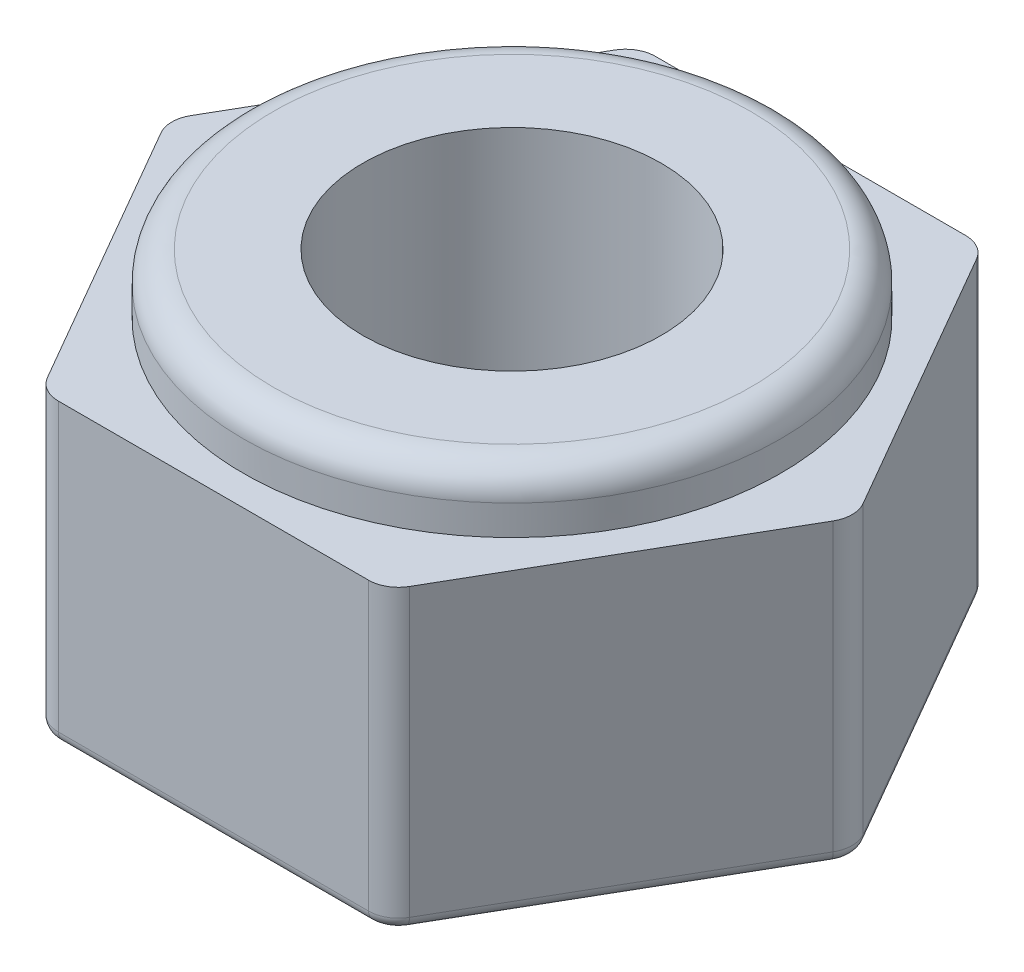
ISO-10303-21;
HEADER;
FILE_DESCRIPTION(('STEP AP214'),'2;1');
FILE_NAME('part.step','',(''),(''),'','','');
FILE_SCHEMA(('AUTOMOTIVE_DESIGN { 1 0 10303 214 1 1 1 1 }'));
ENDSEC;
DATA;
#1=APPLICATION_CONTEXT('core data for automotive mechanical design processes');
#2=APPLICATION_PROTOCOL_DEFINITION('international standard','automotive_design',2000,#1);
#3=PRODUCT_CONTEXT('',#1,'mechanical');
#4=PRODUCT('Part','Part','',(#3));
#5=PRODUCT_RELATED_PRODUCT_CATEGORY('part','',(#4));
#6=PRODUCT_DEFINITION_FORMATION('','',#4);
#7=PRODUCT_DEFINITION_CONTEXT('part definition',#1,'design');
#8=PRODUCT_DEFINITION('design','',#6,#7);
#9=PRODUCT_DEFINITION_SHAPE('','',#8);
#10=(LENGTH_UNIT() NAMED_UNIT(*) SI_UNIT(.MILLI.,.METRE.));
#11=(NAMED_UNIT(*) PLANE_ANGLE_UNIT() SI_UNIT($,.RADIAN.));
#12=(NAMED_UNIT(*) SI_UNIT($,.STERADIAN.) SOLID_ANGLE_UNIT());
#13=UNCERTAINTY_MEASURE_WITH_UNIT(LENGTH_MEASURE(1.E-05),#10,'distance_accuracy_value','');
#14=(GEOMETRIC_REPRESENTATION_CONTEXT(3) GLOBAL_UNCERTAINTY_ASSIGNED_CONTEXT((#13)) GLOBAL_UNIT_ASSIGNED_CONTEXT((#10,
#11,#12)) REPRESENTATION_CONTEXT('',''));
#15=CARTESIAN_POINT('',(0.,0.,0.));
#16=DIRECTION('',(0.,0.,1.));
#17=DIRECTION('',(1.,0.,0.));
#18=AXIS2_PLACEMENT_3D('',#15,#16,#17);
#19=CARTESIAN_POINT('',(-2.88675134594813,6.,-5.));
#20=DIRECTION('',(0.,1.,0.));
#21=DIRECTION('',(0.,0.,1.));
#22=AXIS2_PLACEMENT_3D('',#19,#20,#21);
#23=PLANE('',#22);
#24=CARTESIAN_POINT('',(0.,6.,0.));
#25=DIRECTION('',(0.,1.,0.));
#26=DIRECTION('',(0.,0.,1.));
#27=AXIS2_PLACEMENT_3D('',#24,#25,#26);
#28=CIRCLE('',#27,4.);
#29=CARTESIAN_POINT('',(0.,6.,4.));
#30=VERTEX_POINT('',#29);
#31=EDGE_CURVE('E11',#30,#30,#28,.T.);
#32=ORIENTED_EDGE('',*,*,#31,.T.);
#33=EDGE_LOOP('',(#32));
#34=FACE_BOUND('',#33,.T.);
#35=CARTESIAN_POINT('',(0.,6.,0.));
#36=DIRECTION('',(0.,1.,0.));
#37=DIRECTION('',(0.,0.,1.));
#38=AXIS2_PLACEMENT_3D('',#35,#36,#37);
#39=CIRCLE('',#38,2.5);
#40=CARTESIAN_POINT('',(0.,6.,2.5));
#41=VERTEX_POINT('',#40);
#42=EDGE_CURVE('E435',#41,#41,#39,.T.);
#43=ORIENTED_EDGE('',*,*,#42,.F.);
#44=EDGE_LOOP('',(#43));
#45=FACE_BOUND('',#44,.T.);
#46=ADVANCED_FACE('F36',(#34,#45),#23,.T.);
#47=CARTESIAN_POINT('',(2.88675134594813,6.,-5.));
#48=DIRECTION('',(0.,0.,1.));
#49=DIRECTION('',(1.,0.,0.));
#50=AXIS2_PLACEMENT_3D('',#47,#48,#49);
#51=PLANE('',#50);
#52=DIRECTION('',(-1.,0.,0.));
#53=VECTOR('',#52,1.);
#54=CARTESIAN_POINT('',(2.88675134594813,5.,-5.));
#55=LINE('',#54,#53);
#56=CARTESIAN_POINT('',(2.59807621135332,5.,-5.));
#57=VERTEX_POINT('',#56);
#58=CARTESIAN_POINT('',(-2.59807621135332,5.,-5.));
#59=VERTEX_POINT('',#58);
#60=EDGE_CURVE('E431',#57,#59,#55,.T.);
#61=ORIENTED_EDGE('',*,*,#60,.F.);
#62=DIRECTION('',(0.,-1.,0.));
#63=VECTOR('',#62,1.);
#64=CARTESIAN_POINT('',(2.59807621135332,6.,-5.));
#65=LINE('',#64,#63);
#66=CARTESIAN_POINT('',(2.59807621135332,0.2,-5.));
#67=VERTEX_POINT('',#66);
#68=EDGE_CURVE('E444',#57,#67,#65,.T.);
#69=ORIENTED_EDGE('',*,*,#68,.T.);
#70=DIRECTION('',(-1.,0.,0.));
#71=VECTOR('',#70,1.);
#72=CARTESIAN_POINT('',(2.88675134594813,0.2,-5.));
#73=LINE('',#72,#71);
#74=CARTESIAN_POINT('',(-2.59807621135332,0.2,-5.));
#75=VERTEX_POINT('',#74);
#76=EDGE_CURVE('E223',#67,#75,#73,.T.);
#77=ORIENTED_EDGE('',*,*,#76,.T.);
#78=DIRECTION('',(0.,-1.,0.));
#79=VECTOR('',#78,1.);
#80=CARTESIAN_POINT('',(-2.59807621135332,6.,-5.));
#81=LINE('',#80,#79);
#82=EDGE_CURVE('E446',#75,#59,#81,.F.);
#83=ORIENTED_EDGE('',*,*,#82,.T.);
#84=EDGE_LOOP('',(#61,#69,#77,#83));
#85=FACE_BOUND('',#84,.T.);
#86=ADVANCED_FACE('F297',(#85),#51,.F.);
#87=CARTESIAN_POINT('',(-2.88675134594813,6.,-5.));
#88=DIRECTION('',(0.866025403784438,0.,0.5));
#89=DIRECTION('',(0.5,0.,-0.866025403784439));
#90=AXIS2_PLACEMENT_3D('',#87,#88,#89);
#91=PLANE('',#90);
#92=DIRECTION('',(-0.5,0.,0.866025403784439));
#93=VECTOR('',#92,1.);
#94=CARTESIAN_POINT('',(-2.88675134594813,5.,-5.));
#95=LINE('',#94,#93);
#96=CARTESIAN_POINT('',(-3.03108891324554,5.,-4.75));
#97=VERTEX_POINT('',#96);
#98=CARTESIAN_POINT('',(-5.62916512459885,5.,-0.250000000000003));
#99=VERTEX_POINT('',#98);
#100=EDGE_CURVE('E421',#97,#99,#95,.T.);
#101=ORIENTED_EDGE('',*,*,#100,.F.);
#102=DIRECTION('',(0.,-1.,0.));
#103=VECTOR('',#102,1.);
#104=CARTESIAN_POINT('',(-3.03108891324554,6.,-4.75));
#105=LINE('',#104,#103);
#106=CARTESIAN_POINT('',(-3.03108891324554,0.2,-4.75));
#107=VERTEX_POINT('',#106);
#108=EDGE_CURVE('E442',#97,#107,#105,.T.);
#109=ORIENTED_EDGE('',*,*,#108,.T.);
#110=DIRECTION('',(-0.5,0.,0.866025403784439));
#111=VECTOR('',#110,1.);
#112=CARTESIAN_POINT('',(-2.88675134594813,0.2,-5.));
#113=LINE('',#112,#111);
#114=CARTESIAN_POINT('',(-5.62916512459885,0.2,-0.250000000000003));
#115=VERTEX_POINT('',#114);
#116=EDGE_CURVE('E59',#107,#115,#113,.T.);
#117=ORIENTED_EDGE('',*,*,#116,.T.);
#118=DIRECTION('',(0.,-1.,0.));
#119=VECTOR('',#118,1.);
#120=CARTESIAN_POINT('',(-5.62916512459885,6.,-0.250000000000003));
#121=LINE('',#120,#119);
#122=EDGE_CURVE('E438',#115,#99,#121,.F.);
#123=ORIENTED_EDGE('',*,*,#122,.T.);
#124=EDGE_LOOP('',(#101,#109,#117,#123));
#125=FACE_BOUND('',#124,.T.);
#126=ADVANCED_FACE('F303',(#125),#91,.F.);
#127=CARTESIAN_POINT('',(-5.77350269189626,6.,0.));
#128=DIRECTION('',(0.866025403784439,0.,-0.5));
#129=DIRECTION('',(-0.5,0.,-0.866025403784439));
#130=AXIS2_PLACEMENT_3D('',#127,#128,#129);
#131=PLANE('',#130);
#132=DIRECTION('',(0.5,0.,0.866025403784439));
#133=VECTOR('',#132,1.);
#134=CARTESIAN_POINT('',(-5.77350269189626,5.,0.));
#135=LINE('',#134,#133);
#136=CARTESIAN_POINT('',(-5.62916512459885,5.,0.249999999999997));
#137=VERTEX_POINT('',#136);
#138=CARTESIAN_POINT('',(-3.03108891324554,5.,4.75));
#139=VERTEX_POINT('',#138);
#140=EDGE_CURVE('E51',#137,#139,#135,.T.);
#141=ORIENTED_EDGE('',*,*,#140,.F.);
#142=DIRECTION('',(0.,-1.,0.));
#143=VECTOR('',#142,1.);
#144=CARTESIAN_POINT('',(-5.62916512459885,6.,0.249999999999997));
#145=LINE('',#144,#143);
#146=CARTESIAN_POINT('',(-5.62916512459885,0.2,0.249999999999997));
#147=VERTEX_POINT('',#146);
#148=EDGE_CURVE('E193',#137,#147,#145,.T.);
#149=ORIENTED_EDGE('',*,*,#148,.T.);
#150=DIRECTION('',(0.5,0.,0.866025403784439));
#151=VECTOR('',#150,1.);
#152=CARTESIAN_POINT('',(-5.77350269189626,0.2,0.));
#153=LINE('',#152,#151);
#154=CARTESIAN_POINT('',(-3.03108891324554,0.2,4.75));
#155=VERTEX_POINT('',#154);
#156=EDGE_CURVE('E241',#147,#155,#153,.T.);
#157=ORIENTED_EDGE('',*,*,#156,.T.);
#158=DIRECTION('',(0.,-1.,0.));
#159=VECTOR('',#158,1.);
#160=CARTESIAN_POINT('',(-3.03108891324554,6.,4.75));
#161=LINE('',#160,#159);
#162=EDGE_CURVE('E185',#155,#139,#161,.F.);
#163=ORIENTED_EDGE('',*,*,#162,.T.);
#164=EDGE_LOOP('',(#141,#149,#157,#163));
#165=FACE_BOUND('',#164,.T.);
#166=ADVANCED_FACE('F326',(#165),#131,.F.);
#167=CARTESIAN_POINT('',(-2.88675134594813,6.,5.));
#168=DIRECTION('',(0.,0.,-1.));
#169=DIRECTION('',(-1.,0.,0.));
#170=AXIS2_PLACEMENT_3D('',#167,#168,#169);
#171=PLANE('',#170);
#172=DIRECTION('',(1.,0.,0.));
#173=VECTOR('',#172,1.);
#174=CARTESIAN_POINT('',(-2.88675134594813,5.,5.));
#175=LINE('',#174,#173);
#176=CARTESIAN_POINT('',(-2.59807621135332,5.,5.));
#177=VERTEX_POINT('',#176);
#178=CARTESIAN_POINT('',(2.59807621135332,5.,5.));
#179=VERTEX_POINT('',#178);
#180=EDGE_CURVE('E163',#177,#179,#175,.T.);
#181=ORIENTED_EDGE('',*,*,#180,.F.);
#182=DIRECTION('',(0.,-1.,0.));
#183=VECTOR('',#182,1.);
#184=CARTESIAN_POINT('',(-2.59807621135332,6.,5.));
#185=LINE('',#184,#183);
#186=CARTESIAN_POINT('',(-2.59807621135332,0.2,5.));
#187=VERTEX_POINT('',#186);
#188=EDGE_CURVE('E173',#177,#187,#185,.T.);
#189=ORIENTED_EDGE('',*,*,#188,.T.);
#190=DIRECTION('',(1.,0.,0.));
#191=VECTOR('',#190,1.);
#192=CARTESIAN_POINT('',(-2.88675134594813,0.2,5.));
#193=LINE('',#192,#191);
#194=CARTESIAN_POINT('',(2.59807621135332,0.2,5.));
#195=VERTEX_POINT('',#194);
#196=EDGE_CURVE('E238',#187,#195,#193,.T.);
#197=ORIENTED_EDGE('',*,*,#196,.T.);
#198=DIRECTION('',(0.,-1.,0.));
#199=VECTOR('',#198,1.);
#200=CARTESIAN_POINT('',(2.59807621135332,6.,5.));
#201=LINE('',#200,#199);
#202=EDGE_CURVE('E176',#195,#179,#201,.F.);
#203=ORIENTED_EDGE('',*,*,#202,.T.);
#204=EDGE_LOOP('',(#181,#189,#197,#203));
#205=FACE_BOUND('',#204,.T.);
#206=ADVANCED_FACE('F172',(#205),#171,.F.);
#207=CARTESIAN_POINT('',(2.88675134594813,6.,5.));
#208=DIRECTION('',(-0.866025403784438,0.,-0.5));
#209=DIRECTION('',(-0.5,0.,0.866025403784439));
#210=AXIS2_PLACEMENT_3D('',#207,#208,#209);
#211=PLANE('',#210);
#212=DIRECTION('',(0.5,0.,-0.866025403784439));
#213=VECTOR('',#212,1.);
#214=CARTESIAN_POINT('',(2.88675134594813,5.,5.));
#215=LINE('',#214,#213);
#216=CARTESIAN_POINT('',(3.03108891324553,5.,4.75));
#217=VERTEX_POINT('',#216);
#218=CARTESIAN_POINT('',(5.62916512459885,5.,0.249999999999999));
#219=VERTEX_POINT('',#218);
#220=EDGE_CURVE('E426',#217,#219,#215,.T.);
#221=ORIENTED_EDGE('',*,*,#220,.F.);
#222=DIRECTION('',(0.,-1.,0.));
#223=VECTOR('',#222,1.);
#224=CARTESIAN_POINT('',(3.03108891324553,6.,4.75));
#225=LINE('',#224,#223);
#226=CARTESIAN_POINT('',(3.03108891324553,0.2,4.75));
#227=VERTEX_POINT('',#226);
#228=EDGE_CURVE('E188',#217,#227,#225,.T.);
#229=ORIENTED_EDGE('',*,*,#228,.T.);
#230=DIRECTION('',(0.5,0.,-0.866025403784439));
#231=VECTOR('',#230,1.);
#232=CARTESIAN_POINT('',(2.88675134594813,0.2,5.));
#233=LINE('',#232,#231);
#234=CARTESIAN_POINT('',(5.62916512459885,0.2,0.249999999999999));
#235=VERTEX_POINT('',#234);
#236=EDGE_CURVE('E233',#227,#235,#233,.T.);
#237=ORIENTED_EDGE('',*,*,#236,.T.);
#238=DIRECTION('',(0.,-1.,0.));
#239=VECTOR('',#238,1.);
#240=CARTESIAN_POINT('',(5.62916512459885,6.,0.249999999999999));
#241=LINE('',#240,#239);
#242=EDGE_CURVE('E183',#235,#219,#241,.F.);
#243=ORIENTED_EDGE('',*,*,#242,.T.);
#244=EDGE_LOOP('',(#221,#229,#237,#243));
#245=FACE_BOUND('',#244,.T.);
#246=ADVANCED_FACE('F319',(#245),#211,.F.);
#247=CARTESIAN_POINT('',(5.77350269189626,6.,0.));
#248=DIRECTION('',(-0.866025403784439,0.,0.5));
#249=DIRECTION('',(0.5,0.,0.866025403784439));
#250=AXIS2_PLACEMENT_3D('',#247,#248,#249);
#251=PLANE('',#250);
#252=DIRECTION('',(-0.5,0.,-0.866025403784439));
#253=VECTOR('',#252,1.);
#254=CARTESIAN_POINT('',(5.77350269189626,5.,0.));
#255=LINE('',#254,#253);
#256=CARTESIAN_POINT('',(5.62916512459885,5.,-0.250000000000001));
#257=VERTEX_POINT('',#256);
#258=CARTESIAN_POINT('',(3.03108891324554,5.,-4.75));
#259=VERTEX_POINT('',#258);
#260=EDGE_CURVE('E424',#257,#259,#255,.T.);
#261=ORIENTED_EDGE('',*,*,#260,.F.);
#262=DIRECTION('',(0.,-1.,0.));
#263=VECTOR('',#262,1.);
#264=CARTESIAN_POINT('',(5.62916512459885,6.,-0.250000000000002));
#265=LINE('',#264,#263);
#266=CARTESIAN_POINT('',(5.62916512459885,0.2,-0.250000000000002));
#267=VERTEX_POINT('',#266);
#268=EDGE_CURVE('E418',#257,#267,#265,.T.);
#269=ORIENTED_EDGE('',*,*,#268,.T.);
#270=DIRECTION('',(-0.5,0.,-0.866025403784439));
#271=VECTOR('',#270,1.);
#272=CARTESIAN_POINT('',(5.77350269189626,0.2,0.));
#273=LINE('',#272,#271);
#274=CARTESIAN_POINT('',(3.03108891324554,0.2,-4.75));
#275=VERTEX_POINT('',#274);
#276=EDGE_CURVE('E228',#267,#275,#273,.T.);
#277=ORIENTED_EDGE('',*,*,#276,.T.);
#278=DIRECTION('',(0.,-1.,0.));
#279=VECTOR('',#278,1.);
#280=CARTESIAN_POINT('',(3.03108891324554,6.,-4.75));
#281=LINE('',#280,#279);
#282=EDGE_CURVE('E450',#275,#259,#281,.F.);
#283=ORIENTED_EDGE('',*,*,#282,.T.);
#284=EDGE_LOOP('',(#261,#269,#277,#283));
#285=FACE_BOUND('',#284,.T.);
#286=ADVANCED_FACE('F315',(#285),#251,.F.);
#287=CARTESIAN_POINT('',(-2.59807621135332,6.,-4.5));
#288=DIRECTION('',(0.,-1.,0.));
#289=DIRECTION('',(0.,0.,-1.));
#290=AXIS2_PLACEMENT_3D('',#287,#288,#289);
#291=CYLINDRICAL_SURFACE('',#290,0.5);
#292=ORIENTED_EDGE('',*,*,#108,.F.);
#293=CARTESIAN_POINT('',(-2.59807621135332,5.,-4.5));
#294=DIRECTION('',(0.,1.,0.));
#295=DIRECTION('',(0.,0.,1.));
#296=AXIS2_PLACEMENT_3D('',#293,#294,#295);
#297=CIRCLE('',#296,0.5);
#298=EDGE_CURVE('E420',#97,#59,#297,.F.);
#299=ORIENTED_EDGE('',*,*,#298,.T.);
#300=ORIENTED_EDGE('',*,*,#82,.F.);
#301=CARTESIAN_POINT('',(-2.59807621135332,0.2,-4.5));
#302=DIRECTION('',(0.,1.,0.));
#303=DIRECTION('',(0.,0.,1.));
#304=AXIS2_PLACEMENT_3D('',#301,#302,#303);
#305=CIRCLE('',#304,0.5);
#306=EDGE_CURVE('E220',#75,#107,#305,.T.);
#307=ORIENTED_EDGE('',*,*,#306,.T.);
#308=EDGE_LOOP('',(#292,#299,#300,#307));
#309=FACE_BOUND('',#308,.T.);
#310=ADVANCED_FACE('F318',(#309),#291,.T.);
#311=CARTESIAN_POINT('',(2.59807621135332,6.,-4.5));
#312=DIRECTION('',(0.,-1.,0.));
#313=DIRECTION('',(0.,0.,-1.));
#314=AXIS2_PLACEMENT_3D('',#311,#312,#313);
#315=CYLINDRICAL_SURFACE('',#314,0.5);
#316=ORIENTED_EDGE('',*,*,#68,.F.);
#317=CARTESIAN_POINT('',(2.59807621135332,5.,-4.5));
#318=DIRECTION('',(0.,1.,0.));
#319=DIRECTION('',(0.,0.,1.));
#320=AXIS2_PLACEMENT_3D('',#317,#318,#319);
#321=CIRCLE('',#320,0.5);
#322=EDGE_CURVE('E250',#57,#259,#321,.F.);
#323=ORIENTED_EDGE('',*,*,#322,.T.);
#324=ORIENTED_EDGE('',*,*,#282,.F.);
#325=CARTESIAN_POINT('',(2.59807621135332,0.2,-4.5));
#326=DIRECTION('',(0.,1.,0.));
#327=DIRECTION('',(0.,0.,1.));
#328=AXIS2_PLACEMENT_3D('',#325,#326,#327);
#329=CIRCLE('',#328,0.5);
#330=EDGE_CURVE('E225',#275,#67,#329,.T.);
#331=ORIENTED_EDGE('',*,*,#330,.T.);
#332=EDGE_LOOP('',(#316,#323,#324,#331));
#333=FACE_BOUND('',#332,.T.);
#334=ADVANCED_FACE('F334',(#333),#315,.T.);
#335=CARTESIAN_POINT('',(5.19615242270663,6.,0.));
#336=DIRECTION('',(0.,-1.,0.));
#337=DIRECTION('',(0.,0.,-1.));
#338=AXIS2_PLACEMENT_3D('',#335,#336,#337);
#339=CYLINDRICAL_SURFACE('',#338,0.5);
#340=ORIENTED_EDGE('',*,*,#268,.F.);
#341=CARTESIAN_POINT('',(5.19615242270663,5.,0.));
#342=DIRECTION('',(0.,1.,0.));
#343=DIRECTION('',(0.,0.,1.));
#344=AXIS2_PLACEMENT_3D('',#341,#342,#343);
#345=CIRCLE('',#344,0.5);
#346=EDGE_CURVE('E417',#257,#219,#345,.F.);
#347=ORIENTED_EDGE('',*,*,#346,.T.);
#348=ORIENTED_EDGE('',*,*,#242,.F.);
#349=CARTESIAN_POINT('',(5.19615242270663,0.2,0.));
#350=DIRECTION('',(0.,1.,0.));
#351=DIRECTION('',(0.,0.,1.));
#352=AXIS2_PLACEMENT_3D('',#349,#350,#351);
#353=CIRCLE('',#352,0.5);
#354=EDGE_CURVE('E230',#235,#267,#353,.T.);
#355=ORIENTED_EDGE('',*,*,#354,.T.);
#356=EDGE_LOOP('',(#340,#347,#348,#355));
#357=FACE_BOUND('',#356,.T.);
#358=ADVANCED_FACE('F338',(#357),#339,.T.);
#359=CARTESIAN_POINT('',(2.59807621135332,6.,4.5));
#360=DIRECTION('',(0.,-1.,0.));
#361=DIRECTION('',(0.,0.,-1.));
#362=AXIS2_PLACEMENT_3D('',#359,#360,#361);
#363=CYLINDRICAL_SURFACE('',#362,0.5);
#364=ORIENTED_EDGE('',*,*,#228,.F.);
#365=CARTESIAN_POINT('',(2.59807621135332,5.,4.5));
#366=DIRECTION('',(0.,1.,0.));
#367=DIRECTION('',(0.,0.,1.));
#368=AXIS2_PLACEMENT_3D('',#365,#366,#367);
#369=CIRCLE('',#368,0.5);
#370=EDGE_CURVE('E482',#217,#179,#369,.F.);
#371=ORIENTED_EDGE('',*,*,#370,.T.);
#372=ORIENTED_EDGE('',*,*,#202,.F.);
#373=CARTESIAN_POINT('',(2.59807621135332,0.2,4.5));
#374=DIRECTION('',(0.,1.,0.));
#375=DIRECTION('',(0.,0.,1.));
#376=AXIS2_PLACEMENT_3D('',#373,#374,#375);
#377=CIRCLE('',#376,0.5);
#378=EDGE_CURVE('E235',#195,#227,#377,.T.);
#379=ORIENTED_EDGE('',*,*,#378,.T.);
#380=EDGE_LOOP('',(#364,#371,#372,#379));
#381=FACE_BOUND('',#380,.T.);
#382=ADVANCED_FACE('F342',(#381),#363,.T.);
#383=CARTESIAN_POINT('',(-5.19615242270663,6.,0.));
#384=DIRECTION('',(0.,-1.,0.));
#385=DIRECTION('',(0.,0.,-1.));
#386=AXIS2_PLACEMENT_3D('',#383,#384,#385);
#387=CYLINDRICAL_SURFACE('',#386,0.5);
#388=ORIENTED_EDGE('',*,*,#148,.F.);
#389=CARTESIAN_POINT('',(-5.19615242270663,5.,0.));
#390=DIRECTION('',(0.,1.,0.));
#391=DIRECTION('',(0.,0.,1.));
#392=AXIS2_PLACEMENT_3D('',#389,#390,#391);
#393=CIRCLE('',#392,0.5);
#394=EDGE_CURVE('E483',#137,#99,#393,.F.);
#395=ORIENTED_EDGE('',*,*,#394,.T.);
#396=ORIENTED_EDGE('',*,*,#122,.F.);
#397=CARTESIAN_POINT('',(-5.19615242270663,0.2,0.));
#398=DIRECTION('',(0.,1.,0.));
#399=DIRECTION('',(0.,0.,1.));
#400=AXIS2_PLACEMENT_3D('',#397,#398,#399);
#401=CIRCLE('',#400,0.5);
#402=EDGE_CURVE('E243',#115,#147,#401,.T.);
#403=ORIENTED_EDGE('',*,*,#402,.T.);
#404=EDGE_LOOP('',(#388,#395,#396,#403));
#405=FACE_BOUND('',#404,.T.);
#406=ADVANCED_FACE('F346',(#405),#387,.T.);
#407=CARTESIAN_POINT('',(-2.59807621135332,6.,4.5));
#408=DIRECTION('',(0.,-1.,0.));
#409=DIRECTION('',(0.,0.,-1.));
#410=AXIS2_PLACEMENT_3D('',#407,#408,#409);
#411=CYLINDRICAL_SURFACE('',#410,0.5);
#412=ORIENTED_EDGE('',*,*,#188,.F.);
#413=CARTESIAN_POINT('',(-2.59807621135332,5.,4.5));
#414=DIRECTION('',(0.,1.,0.));
#415=DIRECTION('',(0.,0.,1.));
#416=AXIS2_PLACEMENT_3D('',#413,#414,#415);
#417=CIRCLE('',#416,0.5);
#418=EDGE_CURVE('E159',#177,#139,#417,.F.);
#419=ORIENTED_EDGE('',*,*,#418,.T.);
#420=ORIENTED_EDGE('',*,*,#162,.F.);
#421=CARTESIAN_POINT('',(-2.59807621135332,0.2,4.5));
#422=DIRECTION('',(0.,1.,0.));
#423=DIRECTION('',(0.,0.,1.));
#424=AXIS2_PLACEMENT_3D('',#421,#422,#423);
#425=CIRCLE('',#424,0.5);
#426=EDGE_CURVE('E181',#155,#187,#425,.T.);
#427=ORIENTED_EDGE('',*,*,#426,.T.);
#428=EDGE_LOOP('',(#412,#419,#420,#427));
#429=FACE_BOUND('',#428,.T.);
#430=ADVANCED_FACE('F179',(#429),#411,.T.);
#431=CARTESIAN_POINT('',(-2.88675134594813,0.,-5.));
#432=DIRECTION('',(0.,1.,0.));
#433=DIRECTION('',(0.,0.,1.));
#434=AXIS2_PLACEMENT_3D('',#431,#432,#433);
#435=PLANE('',#434);
#436=DIRECTION('',(-0.5,0.,0.866025403784439));
#437=VECTOR('',#436,1.);
#438=CARTESIAN_POINT('',(-2.71354626519124,0.,-4.9));
#439=LINE('',#438,#437);
#440=CARTESIAN_POINT('',(-5.45596004384196,0.,-0.150000000000003));
#441=VERTEX_POINT('',#440);
#442=CARTESIAN_POINT('',(-2.85788383248865,0.,-4.65));
#443=VERTEX_POINT('',#442);
#444=EDGE_CURVE('E195',#441,#443,#439,.F.);
#445=ORIENTED_EDGE('',*,*,#444,.T.);
#446=CARTESIAN_POINT('',(-2.59807621135332,0.,-4.5));
#447=DIRECTION('',(0.,1.,0.));
#448=DIRECTION('',(0.,0.,1.));
#449=AXIS2_PLACEMENT_3D('',#446,#447,#448);
#450=CIRCLE('',#449,0.3);
#451=CARTESIAN_POINT('',(-2.59807621135332,0.,-4.8));
#452=VERTEX_POINT('',#451);
#453=EDGE_CURVE('E217',#443,#452,#450,.F.);
#454=ORIENTED_EDGE('',*,*,#453,.T.);
#455=DIRECTION('',(-1.,0.,0.));
#456=VECTOR('',#455,1.);
#457=CARTESIAN_POINT('',(-2.88675134594813,0.,-4.8));
#458=LINE('',#457,#456);
#459=CARTESIAN_POINT('',(2.59807621135332,0.,-4.8));
#460=VERTEX_POINT('',#459);
#461=EDGE_CURVE('E215',#452,#460,#458,.F.);
#462=ORIENTED_EDGE('',*,*,#461,.T.);
#463=CARTESIAN_POINT('',(2.59807621135332,0.,-4.5));
#464=DIRECTION('',(0.,1.,0.));
#465=DIRECTION('',(0.,0.,1.));
#466=AXIS2_PLACEMENT_3D('',#463,#464,#465);
#467=CIRCLE('',#466,0.3);
#468=CARTESIAN_POINT('',(2.85788383248865,0.,-4.65));
#469=VERTEX_POINT('',#468);
#470=EDGE_CURVE('E213',#460,#469,#467,.F.);
#471=ORIENTED_EDGE('',*,*,#470,.T.);
#472=DIRECTION('',(-0.5,0.,-0.866025403784439));
#473=VECTOR('',#472,1.);
#474=CARTESIAN_POINT('',(1.27017059221718,0.,-7.4));
#475=LINE('',#474,#473);
#476=CARTESIAN_POINT('',(5.45596004384196,0.,-0.150000000000001));
#477=VERTEX_POINT('',#476);
#478=EDGE_CURVE('E211',#469,#477,#475,.F.);
#479=ORIENTED_EDGE('',*,*,#478,.T.);
#480=CARTESIAN_POINT('',(5.19615242270663,0.,0.));
#481=DIRECTION('',(0.,1.,0.));
#482=DIRECTION('',(0.,0.,1.));
#483=AXIS2_PLACEMENT_3D('',#480,#481,#482);
#484=CIRCLE('',#483,0.3);
#485=CARTESIAN_POINT('',(5.45596004384196,0.,0.149999999999999));
#486=VERTEX_POINT('',#485);
#487=EDGE_CURVE('E209',#477,#486,#484,.F.);
#488=ORIENTED_EDGE('',*,*,#487,.T.);
#489=DIRECTION('',(0.5,0.,-0.866025403784439));
#490=VECTOR('',#489,1.);
#491=CARTESIAN_POINT('',(5.60029761113937,0.,-0.0999999999999985));
#492=LINE('',#491,#490);
#493=CARTESIAN_POINT('',(2.85788383248865,0.,4.65));
#494=VERTEX_POINT('',#493);
#495=EDGE_CURVE('E207',#486,#494,#492,.F.);
#496=ORIENTED_EDGE('',*,*,#495,.T.);
#497=CARTESIAN_POINT('',(2.59807621135332,0.,4.5));
#498=DIRECTION('',(0.,1.,0.));
#499=DIRECTION('',(0.,0.,1.));
#500=AXIS2_PLACEMENT_3D('',#497,#498,#499);
#501=CIRCLE('',#500,0.3);
#502=CARTESIAN_POINT('',(2.59807621135332,0.,4.8));
#503=VERTEX_POINT('',#502);
#504=EDGE_CURVE('E205',#494,#503,#501,.F.);
#505=ORIENTED_EDGE('',*,*,#504,.T.);
#506=DIRECTION('',(1.,0.,0.));
#507=VECTOR('',#506,1.);
#508=CARTESIAN_POINT('',(-2.88675134594813,0.,4.8));
#509=LINE('',#508,#507);
#510=CARTESIAN_POINT('',(-2.59807621135332,0.,4.8));
#511=VERTEX_POINT('',#510);
#512=EDGE_CURVE('E203',#503,#511,#509,.F.);
#513=ORIENTED_EDGE('',*,*,#512,.T.);
#514=CARTESIAN_POINT('',(-2.59807621135332,0.,4.5));
#515=DIRECTION('',(0.,1.,0.));
#516=DIRECTION('',(0.,0.,1.));
#517=AXIS2_PLACEMENT_3D('',#514,#515,#516);
#518=CIRCLE('',#517,0.3);
#519=CARTESIAN_POINT('',(-2.85788383248865,0.,4.65));
#520=VERTEX_POINT('',#519);
#521=EDGE_CURVE('E201',#511,#520,#518,.F.);
#522=ORIENTED_EDGE('',*,*,#521,.T.);
#523=DIRECTION('',(0.5,0.,0.866025403784439));
#524=VECTOR('',#523,1.);
#525=CARTESIAN_POINT('',(-7.04367328411343,0.,-2.6));
#526=LINE('',#525,#524);
#527=CARTESIAN_POINT('',(-5.45596004384196,0.,0.149999999999997));
#528=VERTEX_POINT('',#527);
#529=EDGE_CURVE('E199',#520,#528,#526,.F.);
#530=ORIENTED_EDGE('',*,*,#529,.T.);
#531=CARTESIAN_POINT('',(-5.19615242270663,0.,0.));
#532=DIRECTION('',(0.,1.,0.));
#533=DIRECTION('',(0.,0.,1.));
#534=AXIS2_PLACEMENT_3D('',#531,#532,#533);
#535=CIRCLE('',#534,0.3);
#536=EDGE_CURVE('E197',#528,#441,#535,.F.);
#537=ORIENTED_EDGE('',*,*,#536,.T.);
#538=EDGE_LOOP('',(#445,#454,#462,#471,#479,#488,#496,#505,#513,#522,#530,#537));
#539=FACE_BOUND('',#538,.T.);
#540=CARTESIAN_POINT('',(0.,0.,0.));
#541=DIRECTION('',(0.,1.,0.));
#542=DIRECTION('',(0.,0.,1.));
#543=AXIS2_PLACEMENT_3D('',#540,#541,#542);
#544=CIRCLE('',#543,2.5);
#545=CARTESIAN_POINT('',(0.,0.,2.5));
#546=VERTEX_POINT('',#545);
#547=EDGE_CURVE('E282',#546,#546,#544,.T.);
#548=ORIENTED_EDGE('',*,*,#547,.T.);
#549=EDGE_LOOP('',(#548));
#550=FACE_BOUND('',#549,.T.);
#551=ADVANCED_FACE('F311',(#539,#550),#435,.F.);
#552=CARTESIAN_POINT('',(0.,6.,0.));
#553=DIRECTION('',(0.,-1.,0.));
#554=DIRECTION('',(0.,0.,-1.));
#555=AXIS2_PLACEMENT_3D('',#552,#553,#554);
#556=CYLINDRICAL_SURFACE('',#555,2.5);
#557=ORIENTED_EDGE('',*,*,#42,.T.);
#558=EDGE_LOOP('',(#557));
#559=FACE_BOUND('',#558,.T.);
#560=ORIENTED_EDGE('',*,*,#547,.F.);
#561=EDGE_LOOP('',(#560));
#562=FACE_BOUND('',#561,.T.);
#563=ADVANCED_FACE('F309',(#559,#562),#556,.F.);
#564=CARTESIAN_POINT('',(2.59807621135332,0.2,4.5));
#565=DIRECTION('',(0.,1.,0.));
#566=DIRECTION('',(0.,0.,1.));
#567=AXIS2_PLACEMENT_3D('',#564,#565,#566);
#568=TOROIDAL_SURFACE('',#567,0.3,0.2);
#569=CARTESIAN_POINT('',(2.85788383248865,0.2,4.65));
#570=DIRECTION('',(0.500000000000001,0.,-0.866025403784438));
#571=DIRECTION('',(-0.866025403784438,0.,-0.500000000000001));
#572=AXIS2_PLACEMENT_3D('',#569,#570,#571);
#573=CIRCLE('',#572,0.2);
#574=EDGE_CURVE('E277',#227,#494,#573,.T.);
#575=ORIENTED_EDGE('',*,*,#574,.F.);
#576=ORIENTED_EDGE('',*,*,#378,.F.);
#577=CARTESIAN_POINT('',(2.59807621135332,0.2,4.8));
#578=DIRECTION('',(-1.,0.,0.));
#579=DIRECTION('',(0.,0.,1.));
#580=AXIS2_PLACEMENT_3D('',#577,#578,#579);
#581=CIRCLE('',#580,0.2);
#582=EDGE_CURVE('E280',#503,#195,#581,.T.);
#583=ORIENTED_EDGE('',*,*,#582,.F.);
#584=ORIENTED_EDGE('',*,*,#504,.F.);
#585=EDGE_LOOP('',(#575,#576,#583,#584));
#586=FACE_BOUND('',#585,.T.);
#587=ADVANCED_FACE('F395',(#586),#568,.T.);
#588=CARTESIAN_POINT('',(-2.88675134594813,0.2,4.8));
#589=DIRECTION('',(1.,0.,0.));
#590=DIRECTION('',(0.,0.,-1.));
#591=AXIS2_PLACEMENT_3D('',#588,#589,#590);
#592=CYLINDRICAL_SURFACE('',#591,0.2);
#593=ORIENTED_EDGE('',*,*,#582,.T.);
#594=ORIENTED_EDGE('',*,*,#196,.F.);
#595=CARTESIAN_POINT('',(-2.59807621135332,0.2,4.8));
#596=DIRECTION('',(-1.,0.,0.));
#597=DIRECTION('',(0.,0.,1.));
#598=AXIS2_PLACEMENT_3D('',#595,#596,#597);
#599=CIRCLE('',#598,0.2);
#600=EDGE_CURVE('E274',#511,#187,#599,.T.);
#601=ORIENTED_EDGE('',*,*,#600,.F.);
#602=ORIENTED_EDGE('',*,*,#512,.F.);
#603=EDGE_LOOP('',(#593,#594,#601,#602));
#604=FACE_BOUND('',#603,.T.);
#605=ADVANCED_FACE('F392',(#604),#592,.T.);
#606=CARTESIAN_POINT('',(2.71354626519124,0.2,4.9));
#607=DIRECTION('',(0.5,0.,-0.866025403784439));
#608=DIRECTION('',(-0.866025403784439,0.,-0.5));
#609=AXIS2_PLACEMENT_3D('',#606,#607,#608);
#610=CYLINDRICAL_SURFACE('',#609,0.2);
#611=ORIENTED_EDGE('',*,*,#574,.T.);
#612=ORIENTED_EDGE('',*,*,#495,.F.);
#613=CARTESIAN_POINT('',(5.45596004384196,0.2,0.149999999999998));
#614=DIRECTION('',(0.500000000000001,0.,-0.866025403784438));
#615=DIRECTION('',(-0.866025403784438,0.,-0.500000000000001));
#616=AXIS2_PLACEMENT_3D('',#613,#614,#615);
#617=CIRCLE('',#616,0.2);
#618=EDGE_CURVE('E271',#235,#486,#617,.T.);
#619=ORIENTED_EDGE('',*,*,#618,.F.);
#620=ORIENTED_EDGE('',*,*,#236,.F.);
#621=EDGE_LOOP('',(#611,#612,#619,#620));
#622=FACE_BOUND('',#621,.T.);
#623=ADVANCED_FACE('F388',(#622),#610,.T.);
#624=CARTESIAN_POINT('',(-2.59807621135332,0.2,4.5));
#625=DIRECTION('',(0.,1.,0.));
#626=DIRECTION('',(0.,0.,1.));
#627=AXIS2_PLACEMENT_3D('',#624,#625,#626);
#628=TOROIDAL_SURFACE('',#627,0.3,0.2);
#629=ORIENTED_EDGE('',*,*,#600,.T.);
#630=ORIENTED_EDGE('',*,*,#426,.F.);
#631=CARTESIAN_POINT('',(-2.85788383248865,0.2,4.65));
#632=DIRECTION('',(-0.499999999999998,0.,-0.86602540378444));
#633=DIRECTION('',(-0.86602540378444,0.,0.499999999999998));
#634=AXIS2_PLACEMENT_3D('',#631,#632,#633);
#635=CIRCLE('',#634,0.2);
#636=EDGE_CURVE('E268',#520,#155,#635,.T.);
#637=ORIENTED_EDGE('',*,*,#636,.F.);
#638=ORIENTED_EDGE('',*,*,#521,.F.);
#639=EDGE_LOOP('',(#629,#630,#637,#638));
#640=FACE_BOUND('',#639,.T.);
#641=ADVANCED_FACE('F384',(#640),#628,.T.);
#642=CARTESIAN_POINT('',(5.19615242270663,0.2,0.));
#643=DIRECTION('',(0.,1.,0.));
#644=DIRECTION('',(0.,0.,1.));
#645=AXIS2_PLACEMENT_3D('',#642,#643,#644);
#646=TOROIDAL_SURFACE('',#645,0.3,0.2);
#647=ORIENTED_EDGE('',*,*,#618,.T.);
#648=ORIENTED_EDGE('',*,*,#487,.F.);
#649=CARTESIAN_POINT('',(5.45596004384196,0.2,-0.150000000000002));
#650=DIRECTION('',(-0.500000000000001,0.,-0.866025403784438));
#651=DIRECTION('',(-0.866025403784438,0.,0.500000000000001));
#652=AXIS2_PLACEMENT_3D('',#649,#650,#651);
#653=CIRCLE('',#652,0.2);
#654=EDGE_CURVE('E265',#267,#477,#653,.T.);
#655=ORIENTED_EDGE('',*,*,#654,.F.);
#656=ORIENTED_EDGE('',*,*,#354,.F.);
#657=EDGE_LOOP('',(#647,#648,#655,#656));
#658=FACE_BOUND('',#657,.T.);
#659=ADVANCED_FACE('F380',(#658),#646,.T.);
#660=CARTESIAN_POINT('',(-5.60029761113937,0.2,-0.100000000000002));
#661=DIRECTION('',(0.5,0.,0.866025403784439));
#662=DIRECTION('',(0.866025403784439,0.,-0.5));
#663=AXIS2_PLACEMENT_3D('',#660,#661,#662);
#664=CYLINDRICAL_SURFACE('',#663,0.2);
#665=ORIENTED_EDGE('',*,*,#636,.T.);
#666=ORIENTED_EDGE('',*,*,#156,.F.);
#667=CARTESIAN_POINT('',(-5.45596004384196,0.2,0.149999999999997));
#668=DIRECTION('',(-0.499999999999999,0.,-0.866025403784439));
#669=DIRECTION('',(-0.866025403784439,0.,0.499999999999999));
#670=AXIS2_PLACEMENT_3D('',#667,#668,#669);
#671=CIRCLE('',#670,0.2);
#672=EDGE_CURVE('E262',#528,#147,#671,.T.);
#673=ORIENTED_EDGE('',*,*,#672,.F.);
#674=ORIENTED_EDGE('',*,*,#529,.F.);
#675=EDGE_LOOP('',(#665,#666,#673,#674));
#676=FACE_BOUND('',#675,.T.);
#677=ADVANCED_FACE('F376',(#676),#664,.T.);
#678=CARTESIAN_POINT('',(5.60029761113937,0.2,0.0999999999999983));
#679=DIRECTION('',(-0.5,0.,-0.866025403784439));
#680=DIRECTION('',(-0.866025403784439,0.,0.5));
#681=AXIS2_PLACEMENT_3D('',#678,#679,#680);
#682=CYLINDRICAL_SURFACE('',#681,0.2);
#683=ORIENTED_EDGE('',*,*,#654,.T.);
#684=ORIENTED_EDGE('',*,*,#478,.F.);
#685=CARTESIAN_POINT('',(2.85788383248865,0.2,-4.65));
#686=DIRECTION('',(-0.500000000000001,0.,-0.866025403784438));
#687=DIRECTION('',(-0.866025403784438,0.,0.500000000000001));
#688=AXIS2_PLACEMENT_3D('',#685,#686,#687);
#689=CIRCLE('',#688,0.2);
#690=EDGE_CURVE('E259',#275,#469,#689,.T.);
#691=ORIENTED_EDGE('',*,*,#690,.F.);
#692=ORIENTED_EDGE('',*,*,#276,.F.);
#693=EDGE_LOOP('',(#683,#684,#691,#692));
#694=FACE_BOUND('',#693,.T.);
#695=ADVANCED_FACE('F372',(#694),#682,.T.);
#696=CARTESIAN_POINT('',(-5.19615242270663,0.2,0.));
#697=DIRECTION('',(0.,1.,0.));
#698=DIRECTION('',(0.,0.,1.));
#699=AXIS2_PLACEMENT_3D('',#696,#697,#698);
#700=TOROIDAL_SURFACE('',#699,0.3,0.2);
#701=ORIENTED_EDGE('',*,*,#672,.T.);
#702=ORIENTED_EDGE('',*,*,#402,.F.);
#703=CARTESIAN_POINT('',(-5.45596004384196,0.2,-0.150000000000003));
#704=DIRECTION('',(0.5,0.,-0.866025403784439));
#705=DIRECTION('',(-0.866025403784439,0.,-0.5));
#706=AXIS2_PLACEMENT_3D('',#703,#704,#705);
#707=CIRCLE('',#706,0.2);
#708=EDGE_CURVE('E256',#441,#115,#707,.T.);
#709=ORIENTED_EDGE('',*,*,#708,.F.);
#710=ORIENTED_EDGE('',*,*,#536,.F.);
#711=EDGE_LOOP('',(#701,#702,#709,#710));
#712=FACE_BOUND('',#711,.T.);
#713=ADVANCED_FACE('F368',(#712),#700,.T.);
#714=CARTESIAN_POINT('',(2.59807621135332,0.2,-4.5));
#715=DIRECTION('',(0.,1.,0.));
#716=DIRECTION('',(0.,0.,1.));
#717=AXIS2_PLACEMENT_3D('',#714,#715,#716);
#718=TOROIDAL_SURFACE('',#717,0.3,0.2);
#719=ORIENTED_EDGE('',*,*,#690,.T.);
#720=ORIENTED_EDGE('',*,*,#470,.F.);
#721=CARTESIAN_POINT('',(2.59807621135332,0.2,-4.8));
#722=DIRECTION('',(-1.,0.,0.));
#723=DIRECTION('',(0.,0.,1.));
#724=AXIS2_PLACEMENT_3D('',#721,#722,#723);
#725=CIRCLE('',#724,0.2);
#726=EDGE_CURVE('E253',#67,#460,#725,.T.);
#727=ORIENTED_EDGE('',*,*,#726,.F.);
#728=ORIENTED_EDGE('',*,*,#330,.F.);
#729=EDGE_LOOP('',(#719,#720,#727,#728));
#730=FACE_BOUND('',#729,.T.);
#731=ADVANCED_FACE('F364',(#730),#718,.T.);
#732=CARTESIAN_POINT('',(-2.71354626519124,0.2,-4.9));
#733=DIRECTION('',(-0.5,0.,0.866025403784439));
#734=DIRECTION('',(0.866025403784439,0.,0.5));
#735=AXIS2_PLACEMENT_3D('',#732,#733,#734);
#736=CYLINDRICAL_SURFACE('',#735,0.2);
#737=ORIENTED_EDGE('',*,*,#708,.T.);
#738=ORIENTED_EDGE('',*,*,#116,.F.);
#739=CARTESIAN_POINT('',(-2.85788383248865,0.2,-4.65));
#740=DIRECTION('',(0.500000000000001,0.,-0.866025403784438));
#741=DIRECTION('',(-0.866025403784438,0.,-0.500000000000001));
#742=AXIS2_PLACEMENT_3D('',#739,#740,#741);
#743=CIRCLE('',#742,0.2);
#744=EDGE_CURVE('E249',#443,#107,#743,.T.);
#745=ORIENTED_EDGE('',*,*,#744,.F.);
#746=ORIENTED_EDGE('',*,*,#444,.F.);
#747=EDGE_LOOP('',(#737,#738,#745,#746));
#748=FACE_BOUND('',#747,.T.);
#749=ADVANCED_FACE('F360',(#748),#736,.T.);
#750=CARTESIAN_POINT('',(2.88675134594813,0.2,-4.8));
#751=DIRECTION('',(-1.,0.,0.));
#752=DIRECTION('',(0.,0.,1.));
#753=AXIS2_PLACEMENT_3D('',#750,#751,#752);
#754=CYLINDRICAL_SURFACE('',#753,0.2);
#755=ORIENTED_EDGE('',*,*,#726,.T.);
#756=ORIENTED_EDGE('',*,*,#461,.F.);
#757=CARTESIAN_POINT('',(-2.59807621135332,0.2,-4.8));
#758=DIRECTION('',(-1.,0.,0.));
#759=DIRECTION('',(0.,0.,1.));
#760=AXIS2_PLACEMENT_3D('',#757,#758,#759);
#761=CIRCLE('',#760,0.2);
#762=EDGE_CURVE('E247',#75,#452,#761,.T.);
#763=ORIENTED_EDGE('',*,*,#762,.F.);
#764=ORIENTED_EDGE('',*,*,#76,.F.);
#765=EDGE_LOOP('',(#755,#756,#763,#764));
#766=FACE_BOUND('',#765,.T.);
#767=ADVANCED_FACE('F356',(#766),#754,.T.);
#768=CARTESIAN_POINT('',(-2.59807621135332,0.2,-4.5));
#769=DIRECTION('',(0.,1.,0.));
#770=DIRECTION('',(0.,0.,1.));
#771=AXIS2_PLACEMENT_3D('',#768,#769,#770);
#772=TOROIDAL_SURFACE('',#771,0.3,0.2);
#773=ORIENTED_EDGE('',*,*,#744,.T.);
#774=ORIENTED_EDGE('',*,*,#306,.F.);
#775=ORIENTED_EDGE('',*,*,#762,.T.);
#776=ORIENTED_EDGE('',*,*,#453,.F.);
#777=EDGE_LOOP('',(#773,#774,#775,#776));
#778=FACE_BOUND('',#777,.T.);
#779=ADVANCED_FACE('F353',(#778),#772,.T.);
#780=CARTESIAN_POINT('',(-7.,5.,0.));
#781=DIRECTION('',(0.,1.,0.));
#782=DIRECTION('',(0.,0.,1.));
#783=AXIS2_PLACEMENT_3D('',#780,#781,#782);
#784=PLANE('',#783);
#785=ORIENTED_EDGE('',*,*,#60,.T.);
#786=ORIENTED_EDGE('',*,*,#298,.F.);
#787=ORIENTED_EDGE('',*,*,#100,.T.);
#788=ORIENTED_EDGE('',*,*,#394,.F.);
#789=ORIENTED_EDGE('',*,*,#140,.T.);
#790=ORIENTED_EDGE('',*,*,#418,.F.);
#791=ORIENTED_EDGE('',*,*,#180,.T.);
#792=ORIENTED_EDGE('',*,*,#370,.F.);
#793=ORIENTED_EDGE('',*,*,#220,.T.);
#794=ORIENTED_EDGE('',*,*,#346,.F.);
#795=ORIENTED_EDGE('',*,*,#260,.T.);
#796=ORIENTED_EDGE('',*,*,#322,.F.);
#797=EDGE_LOOP('',(#785,#786,#787,#788,#789,#790,#791,#792,#793,#794,#795,#796));
#798=FACE_BOUND('',#797,.T.);
#799=CARTESIAN_POINT('',(0.,5.,0.));
#800=DIRECTION('',(0.,-1.,0.));
#801=DIRECTION('',(0.,0.,-1.));
#802=AXIS2_PLACEMENT_3D('',#799,#800,#801);
#803=CIRCLE('',#802,4.5);
#804=CARTESIAN_POINT('',(0.,5.,-4.5));
#805=VERTEX_POINT('',#804);
#806=EDGE_CURVE('E177',#805,#805,#803,.T.);
#807=ORIENTED_EDGE('',*,*,#806,.T.);
#808=EDGE_LOOP('',(#807));
#809=FACE_BOUND('',#808,.T.);
#810=ADVANCED_FACE('F161',(#798,#809),#784,.T.);
#811=CARTESIAN_POINT('',(0.,0.,0.));
#812=DIRECTION('',(0.,-1.,0.));
#813=DIRECTION('',(0.,0.,-1.));
#814=AXIS2_PLACEMENT_3D('',#811,#812,#813);
#815=CYLINDRICAL_SURFACE('',#814,4.5);
#816=CARTESIAN_POINT('',(0.,5.5,0.));
#817=DIRECTION('',(0.,1.,0.));
#818=DIRECTION('',(0.,0.,1.));
#819=AXIS2_PLACEMENT_3D('',#816,#817,#818);
#820=CIRCLE('',#819,4.5);
#821=CARTESIAN_POINT('',(0.,5.5,4.5));
#822=VERTEX_POINT('',#821);
#823=EDGE_CURVE('E44',#822,#822,#820,.F.);
#824=ORIENTED_EDGE('',*,*,#823,.T.);
#825=EDGE_LOOP('',(#824));
#826=FACE_BOUND('',#825,.T.);
#827=ORIENTED_EDGE('',*,*,#806,.F.);
#828=EDGE_LOOP('',(#827));
#829=FACE_BOUND('',#828,.T.);
#830=ADVANCED_FACE('F286',(#826,#829),#815,.T.);
#831=CARTESIAN_POINT('',(0.,5.5,0.));
#832=DIRECTION('',(0.,1.,0.));
#833=DIRECTION('',(0.,0.,1.));
#834=AXIS2_PLACEMENT_3D('',#831,#832,#833);
#835=TOROIDAL_SURFACE('',#834,4.,0.5);
#836=ORIENTED_EDGE('',*,*,#31,.F.);
#837=EDGE_LOOP('',(#836));
#838=FACE_BOUND('',#837,.T.);
#839=ORIENTED_EDGE('',*,*,#823,.F.);
#840=EDGE_LOOP('',(#839));
#841=FACE_BOUND('',#840,.T.);
#842=ADVANCED_FACE('F38',(#838,#841),#835,.T.);
#843=CLOSED_SHELL('',(#46,#86,#126,#166,#206,#246,#286,#310,#334,#358,#382,#406,#430,#551,#563,
#587,#605,#623,#641,#659,#677,#695,#713,#731,#749,#767,#779,#810,#830,#842));
#844=MANIFOLD_SOLID_BREP('B2',#843);
#845=ADVANCED_BREP_SHAPE_REPRESENTATION('',(#18,#844),#14);
#846=SHAPE_DEFINITION_REPRESENTATION(#9,#845);
ENDSEC;
END-ISO-10303-21;
